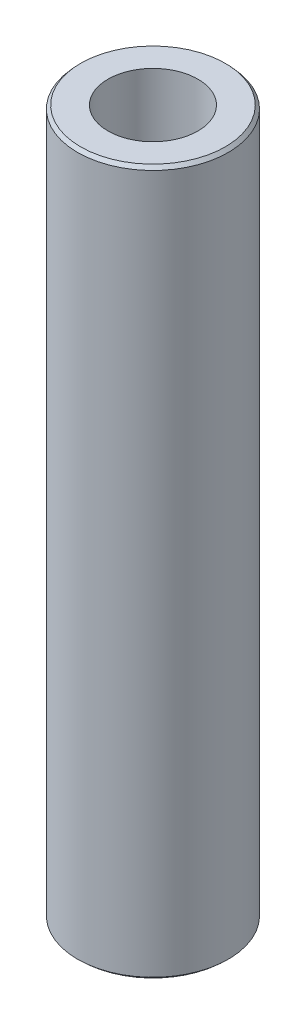
ISO-10303-21;
HEADER;
FILE_DESCRIPTION(('STEP AP214'),'2;1');
FILE_NAME('part.step','',(''),(''),'','','');
FILE_SCHEMA(('AUTOMOTIVE_DESIGN { 1 0 10303 214 1 1 1 1 }'));
ENDSEC;
DATA;
#1=APPLICATION_CONTEXT('core data for automotive mechanical design processes');
#2=APPLICATION_PROTOCOL_DEFINITION('international standard','automotive_design',2000,#1);
#3=PRODUCT_CONTEXT('',#1,'mechanical');
#4=PRODUCT('Part','Part','',(#3));
#5=PRODUCT_RELATED_PRODUCT_CATEGORY('part','',(#4));
#6=PRODUCT_DEFINITION_FORMATION('','',#4);
#7=PRODUCT_DEFINITION_CONTEXT('part definition',#1,'design');
#8=PRODUCT_DEFINITION('design','',#6,#7);
#9=PRODUCT_DEFINITION_SHAPE('','',#8);
#10=(LENGTH_UNIT() NAMED_UNIT(*) SI_UNIT(.MILLI.,.METRE.));
#11=(NAMED_UNIT(*) PLANE_ANGLE_UNIT() SI_UNIT($,.RADIAN.));
#12=(NAMED_UNIT(*) SI_UNIT($,.STERADIAN.) SOLID_ANGLE_UNIT());
#13=UNCERTAINTY_MEASURE_WITH_UNIT(LENGTH_MEASURE(1.E-05),#10,'distance_accuracy_value','');
#14=(GEOMETRIC_REPRESENTATION_CONTEXT(3) GLOBAL_UNCERTAINTY_ASSIGNED_CONTEXT((#13)) GLOBAL_UNIT_ASSIGNED_CONTEXT((#10,
#11,#12)) REPRESENTATION_CONTEXT('',''));
#15=CARTESIAN_POINT('',(0.,0.,0.));
#16=DIRECTION('',(0.,0.,1.));
#17=DIRECTION('',(1.,0.,0.));
#18=AXIS2_PLACEMENT_3D('',#15,#16,#17);
#19=CARTESIAN_POINT('',(0.,140.305806075026,0.));
#20=DIRECTION('',(0.,-1.,0.));
#21=DIRECTION('',(0.,0.,-1.));
#22=AXIS2_PLACEMENT_3D('',#19,#20,#21);
#23=CYLINDRICAL_SURFACE('',#22,15.);
#24=CARTESIAN_POINT('',(0.,139.637379696819,0.));
#25=DIRECTION('',(0.,1.,0.));
#26=DIRECTION('',(0.,0.,1.));
#27=AXIS2_PLACEMENT_3D('',#24,#25,#26);
#28=CIRCLE('',#27,15.);
#29=CARTESIAN_POINT('',(0.,139.637379696819,15.));
#30=VERTEX_POINT('',#29);
#31=EDGE_CURVE('E50',#30,#30,#28,.F.);
#32=ORIENTED_EDGE('',*,*,#31,.T.);
#33=EDGE_LOOP('',(#32));
#34=FACE_BOUND('',#33,.T.);
#35=CARTESIAN_POINT('',(0.,0.600912812609156,0.));
#36=DIRECTION('',(0.,1.,0.));
#37=DIRECTION('',(0.,0.,1.));
#38=AXIS2_PLACEMENT_3D('',#35,#36,#37);
#39=CIRCLE('',#38,15.);
#40=CARTESIAN_POINT('',(0.,0.600912812609156,15.));
#41=VERTEX_POINT('',#40);
#42=EDGE_CURVE('E51',#41,#41,#39,.T.);
#43=ORIENTED_EDGE('',*,*,#42,.T.);
#44=EDGE_LOOP('',(#43));
#45=FACE_BOUND('',#44,.T.);
#46=ADVANCED_FACE('F39',(#34,#45),#23,.T.);
#47=CARTESIAN_POINT('',(0.,140.305806075026,0.));
#48=DIRECTION('',(0.,1.,0.));
#49=DIRECTION('',(0.,0.,1.));
#50=AXIS2_PLACEMENT_3D('',#47,#48,#49);
#51=PLANE('',#50);
#52=CARTESIAN_POINT('',(0.,140.305806075026,0.));
#53=DIRECTION('',(0.,1.,0.));
#54=DIRECTION('',(0.,0.,1.));
#55=AXIS2_PLACEMENT_3D('',#52,#53,#54);
#56=CIRCLE('',#55,14.3990871873908);
#57=CARTESIAN_POINT('',(0.,140.305806075026,14.3990871873908));
#58=VERTEX_POINT('',#57);
#59=EDGE_CURVE('E54',#58,#58,#56,.T.);
#60=ORIENTED_EDGE('',*,*,#59,.T.);
#61=EDGE_LOOP('',(#60));
#62=FACE_BOUND('',#61,.T.);
#63=CARTESIAN_POINT('',(0.,140.305806075026,0.));
#64=DIRECTION('',(0.,1.,0.));
#65=DIRECTION('',(0.,0.,1.));
#66=AXIS2_PLACEMENT_3D('',#63,#64,#65);
#67=CIRCLE('',#66,8.94732517329714);
#68=CARTESIAN_POINT('',(0.,140.305806075026,8.94732517329714));
#69=VERTEX_POINT('',#68);
#70=EDGE_CURVE('E58',#69,#69,#67,.T.);
#71=ORIENTED_EDGE('',*,*,#70,.F.);
#72=EDGE_LOOP('',(#71));
#73=FACE_BOUND('',#72,.T.);
#74=ADVANCED_FACE('F69',(#62,#73),#51,.T.);
#75=CARTESIAN_POINT('',(0.,0.,0.));
#76=DIRECTION('',(0.,1.,0.));
#77=DIRECTION('',(0.,0.,1.));
#78=AXIS2_PLACEMENT_3D('',#75,#76,#77);
#79=PLANE('',#78);
#80=CARTESIAN_POINT('',(0.,0.,0.));
#81=DIRECTION('',(0.,1.,0.));
#82=DIRECTION('',(0.,0.,1.));
#83=AXIS2_PLACEMENT_3D('',#80,#81,#82);
#84=CIRCLE('',#83,14.3315736217935);
#85=CARTESIAN_POINT('',(0.,0.,14.3315736217935));
#86=VERTEX_POINT('',#85);
#87=EDGE_CURVE('E10',#86,#86,#84,.F.);
#88=ORIENTED_EDGE('',*,*,#87,.T.);
#89=EDGE_LOOP('',(#88));
#90=FACE_BOUND('',#89,.T.);
#91=CARTESIAN_POINT('',(0.,0.,0.));
#92=DIRECTION('',(0.,1.,0.));
#93=DIRECTION('',(0.,0.,1.));
#94=AXIS2_PLACEMENT_3D('',#91,#92,#93);
#95=CIRCLE('',#94,8.94732517329714);
#96=CARTESIAN_POINT('',(0.,0.,8.94732517329714));
#97=VERTEX_POINT('',#96);
#98=EDGE_CURVE('E63',#97,#97,#95,.T.);
#99=ORIENTED_EDGE('',*,*,#98,.T.);
#100=EDGE_LOOP('',(#99));
#101=FACE_BOUND('',#100,.T.);
#102=ADVANCED_FACE('F75',(#90,#101),#79,.F.);
#103=CARTESIAN_POINT('',(0.,140.305806075026,0.));
#104=DIRECTION('',(0.,-1.,0.));
#105=DIRECTION('',(0.,0.,-1.));
#106=AXIS2_PLACEMENT_3D('',#103,#104,#105);
#107=CYLINDRICAL_SURFACE('',#106,8.94732517329714);
#108=ORIENTED_EDGE('',*,*,#70,.T.);
#109=EDGE_LOOP('',(#108));
#110=FACE_BOUND('',#109,.T.);
#111=ORIENTED_EDGE('',*,*,#98,.F.);
#112=EDGE_LOOP('',(#111));
#113=FACE_BOUND('',#112,.T.);
#114=ADVANCED_FACE('F70',(#110,#113),#107,.F.);
#115=CARTESIAN_POINT('',(0.,140.305806075026,0.));
#116=DIRECTION('',(0.,-1.,0.));
#117=DIRECTION('',(0.,0.,-1.));
#118=AXIS2_PLACEMENT_3D('',#115,#116,#117);
#119=CONICAL_SURFACE('',#118,14.3990871873908,0.73226027121575);
#120=ORIENTED_EDGE('',*,*,#31,.F.);
#121=EDGE_LOOP('',(#120));
#122=FACE_BOUND('',#121,.T.);
#123=ORIENTED_EDGE('',*,*,#59,.F.);
#124=EDGE_LOOP('',(#123));
#125=FACE_BOUND('',#124,.T.);
#126=ADVANCED_FACE('F81',(#122,#125),#119,.T.);
#127=CARTESIAN_POINT('',(0.,0.600912812609156,0.));
#128=DIRECTION('',(0.,1.,0.));
#129=DIRECTION('',(0.,0.,1.));
#130=AXIS2_PLACEMENT_3D('',#127,#128,#129);
#131=CONICAL_SURFACE('',#130,15.,0.838536055579147);
#132=ORIENTED_EDGE('',*,*,#87,.F.);
#133=EDGE_LOOP('',(#132));
#134=FACE_BOUND('',#133,.T.);
#135=ORIENTED_EDGE('',*,*,#42,.F.);
#136=EDGE_LOOP('',(#135));
#137=FACE_BOUND('',#136,.T.);
#138=ADVANCED_FACE('F45',(#134,#137),#131,.T.);
#139=CLOSED_SHELL('',(#46,#74,#102,#114,#126,#138));
#140=MANIFOLD_SOLID_BREP('B2',#139);
#141=ADVANCED_BREP_SHAPE_REPRESENTATION('',(#18,#140),#14);
#142=SHAPE_DEFINITION_REPRESENTATION(#9,#141);
ENDSEC;
END-ISO-10303-21;
